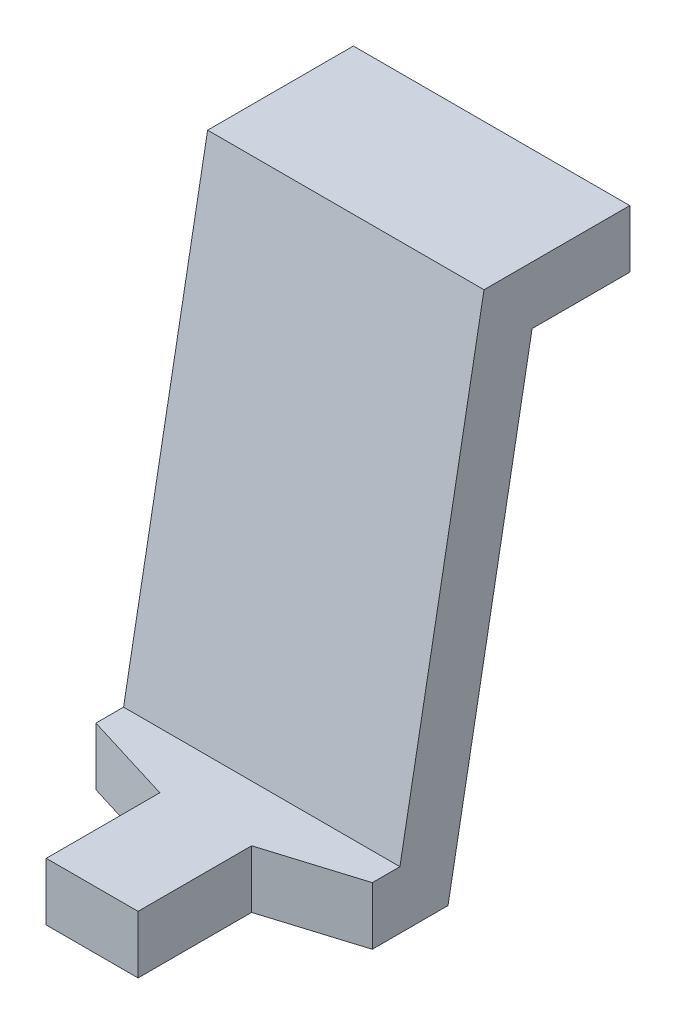
ISO-10303-21;
HEADER;
FILE_DESCRIPTION(('STEP AP214'),'2;1');
FILE_NAME('part.step','',(''),(''),'','','');
FILE_SCHEMA(('AUTOMOTIVE_DESIGN { 1 0 10303 214 1 1 1 1 }'));
ENDSEC;
DATA;
#1=APPLICATION_CONTEXT('core data for automotive mechanical design processes');
#2=APPLICATION_PROTOCOL_DEFINITION('international standard','automotive_design',2000,#1);
#3=PRODUCT_CONTEXT('',#1,'mechanical');
#4=PRODUCT('Part','Part','',(#3));
#5=PRODUCT_RELATED_PRODUCT_CATEGORY('part','',(#4));
#6=PRODUCT_DEFINITION_FORMATION('','',#4);
#7=PRODUCT_DEFINITION_CONTEXT('part definition',#1,'design');
#8=PRODUCT_DEFINITION('design','',#6,#7);
#9=PRODUCT_DEFINITION_SHAPE('','',#8);
#10=(LENGTH_UNIT() NAMED_UNIT(*) SI_UNIT(.MILLI.,.METRE.));
#11=(NAMED_UNIT(*) PLANE_ANGLE_UNIT() SI_UNIT($,.RADIAN.));
#12=(NAMED_UNIT(*) SI_UNIT($,.STERADIAN.) SOLID_ANGLE_UNIT());
#13=UNCERTAINTY_MEASURE_WITH_UNIT(LENGTH_MEASURE(1.E-05),#10,'distance_accuracy_value','');
#14=(GEOMETRIC_REPRESENTATION_CONTEXT(3) GLOBAL_UNCERTAINTY_ASSIGNED_CONTEXT((#13)) GLOBAL_UNIT_ASSIGNED_CONTEXT((#10,
#11,#12)) REPRESENTATION_CONTEXT('',''));
#15=CARTESIAN_POINT('',(0.,0.,0.));
#16=DIRECTION('',(0.,0.,1.));
#17=DIRECTION('',(1.,0.,0.));
#18=AXIS2_PLACEMENT_3D('',#15,#16,#17);
#19=CARTESIAN_POINT('',(0.4875,-2.7225,1.91));
#20=DIRECTION('',(1.,0.,0.));
#21=DIRECTION('',(0.,0.,-1.));
#22=AXIS2_PLACEMENT_3D('',#19,#20,#21);
#23=PLANE('',#22);
#24=DIRECTION('',(0.,0.,-1.));
#25=VECTOR('',#24,1.);
#26=CARTESIAN_POINT('',(0.4875,-2.4175,1.91));
#27=LINE('',#26,#25);
#28=CARTESIAN_POINT('',(0.4875,-2.4175,1.91));
#29=VERTEX_POINT('',#28);
#30=CARTESIAN_POINT('',(0.4875,-2.4175,1.31));
#31=VERTEX_POINT('',#30);
#32=EDGE_CURVE('E189',#29,#31,#27,.T.);
#33=ORIENTED_EDGE('',*,*,#32,.T.);
#34=DIRECTION('',(0.,1.,0.));
#35=VECTOR('',#34,1.);
#36=CARTESIAN_POINT('',(0.4875,-2.7225,1.31));
#37=LINE('',#36,#35);
#38=CARTESIAN_POINT('',(0.4875,-2.7225,1.31));
#39=VERTEX_POINT('',#38);
#40=EDGE_CURVE('E11',#39,#31,#37,.T.);
#41=ORIENTED_EDGE('',*,*,#40,.F.);
#42=DIRECTION('',(0.,0.,-1.));
#43=VECTOR('',#42,1.);
#44=CARTESIAN_POINT('',(0.4875,-2.7225,1.91));
#45=LINE('',#44,#43);
#46=CARTESIAN_POINT('',(0.4875,-2.7225,1.91));
#47=VERTEX_POINT('',#46);
#48=EDGE_CURVE('E207',#47,#39,#45,.T.);
#49=ORIENTED_EDGE('',*,*,#48,.F.);
#50=DIRECTION('',(0.,1.,0.));
#51=VECTOR('',#50,1.);
#52=CARTESIAN_POINT('',(0.4875,-2.7225,1.91));
#53=LINE('',#52,#51);
#54=EDGE_CURVE('E197',#47,#29,#53,.T.);
#55=ORIENTED_EDGE('',*,*,#54,.T.);
#56=EDGE_LOOP('',(#33,#41,#49,#55));
#57=FACE_BOUND('',#56,.T.);
#58=ADVANCED_FACE('F17',(#57),#23,.F.);
#59=CARTESIAN_POINT('',(0.4875,-2.7225,1.31));
#60=DIRECTION('',(0.294085848837945,0.,-0.95577900872182));
#61=DIRECTION('',(0.,-1.,0.));
#62=AXIS2_PLACEMENT_3D('',#59,#60,#61);
#63=PLANE('',#62);
#64=DIRECTION('',(-0.95577900872182,0.,-0.294085848837945));
#65=VECTOR('',#64,1.);
#66=CARTESIAN_POINT('',(0.4875,-2.4175,1.31));
#67=LINE('',#66,#65);
#68=CARTESIAN_POINT('',(0.,-2.4175,1.16));
#69=VERTEX_POINT('',#68);
#70=EDGE_CURVE('E181',#31,#69,#67,.T.);
#71=ORIENTED_EDGE('',*,*,#70,.T.);
#72=DIRECTION('',(0.,1.,0.));
#73=VECTOR('',#72,1.);
#74=CARTESIAN_POINT('',(0.,-2.7225,1.16));
#75=LINE('',#74,#73);
#76=CARTESIAN_POINT('',(0.,-2.7225,1.16));
#77=VERTEX_POINT('',#76);
#78=EDGE_CURVE('E145',#77,#69,#75,.T.);
#79=ORIENTED_EDGE('',*,*,#78,.F.);
#80=DIRECTION('',(-0.95577900872182,0.,-0.294085848837945));
#81=VECTOR('',#80,1.);
#82=CARTESIAN_POINT('',(0.4875,-2.7225,1.31));
#83=LINE('',#82,#81);
#84=EDGE_CURVE('E211',#39,#77,#83,.T.);
#85=ORIENTED_EDGE('',*,*,#84,.F.);
#86=ORIENTED_EDGE('',*,*,#40,.T.);
#87=EDGE_LOOP('',(#71,#79,#85,#86));
#88=FACE_BOUND('',#87,.T.);
#89=ADVANCED_FACE('F19',(#88),#63,.F.);
#90=CARTESIAN_POINT('',(0.9725,-2.7225,1.31));
#91=DIRECTION('',(-0.294085848837945,0.,-0.95577900872182));
#92=DIRECTION('',(-0.95577900872182,0.,0.294085848837945));
#93=AXIS2_PLACEMENT_3D('',#90,#91,#92);
#94=PLANE('',#93);
#95=DIRECTION('',(-0.95577900872182,0.,0.294085848837945));
#96=VECTOR('',#95,1.);
#97=CARTESIAN_POINT('',(0.9725,-2.4175,1.31));
#98=LINE('',#97,#96);
#99=CARTESIAN_POINT('',(1.46,-2.4175,1.16));
#100=VERTEX_POINT('',#99);
#101=CARTESIAN_POINT('',(0.9725,-2.4175,1.31));
#102=VERTEX_POINT('',#101);
#103=EDGE_CURVE('E171',#100,#102,#98,.T.);
#104=ORIENTED_EDGE('',*,*,#103,.T.);
#105=DIRECTION('',(0.,1.,0.));
#106=VECTOR('',#105,1.);
#107=CARTESIAN_POINT('',(0.9725,-2.7225,1.31));
#108=LINE('',#107,#106);
#109=CARTESIAN_POINT('',(0.9725,-2.7225,1.31));
#110=VERTEX_POINT('',#109);
#111=EDGE_CURVE('E21',#110,#102,#108,.T.);
#112=ORIENTED_EDGE('',*,*,#111,.F.);
#113=DIRECTION('',(-0.95577900872182,0.,0.294085848837945));
#114=VECTOR('',#113,1.);
#115=CARTESIAN_POINT('',(0.9725,-2.7225,1.31));
#116=LINE('',#115,#114);
#117=CARTESIAN_POINT('',(1.46,-2.7225,1.16));
#118=VERTEX_POINT('',#117);
#119=EDGE_CURVE('E227',#118,#110,#116,.T.);
#120=ORIENTED_EDGE('',*,*,#119,.F.);
#121=DIRECTION('',(0.,1.,0.));
#122=VECTOR('',#121,1.);
#123=CARTESIAN_POINT('',(1.46,-2.7225,1.16));
#124=LINE('',#123,#122);
#125=EDGE_CURVE('E146',#118,#100,#124,.T.);
#126=ORIENTED_EDGE('',*,*,#125,.T.);
#127=EDGE_LOOP('',(#104,#112,#120,#126));
#128=FACE_BOUND('',#127,.T.);
#129=ADVANCED_FACE('F266',(#128),#94,.F.);
#130=CARTESIAN_POINT('',(0.9725,-2.7225,1.91));
#131=DIRECTION('',(-1.,0.,0.));
#132=DIRECTION('',(0.,0.,1.));
#133=AXIS2_PLACEMENT_3D('',#130,#131,#132);
#134=PLANE('',#133);
#135=DIRECTION('',(0.,0.,1.));
#136=VECTOR('',#135,1.);
#137=CARTESIAN_POINT('',(0.9725,-2.4175,1.91));
#138=LINE('',#137,#136);
#139=CARTESIAN_POINT('',(0.9725,-2.4175,1.91));
#140=VERTEX_POINT('',#139);
#141=EDGE_CURVE('E168',#102,#140,#138,.T.);
#142=ORIENTED_EDGE('',*,*,#141,.T.);
#143=DIRECTION('',(0.,1.,0.));
#144=VECTOR('',#143,1.);
#145=CARTESIAN_POINT('',(0.9725,-2.7225,1.91));
#146=LINE('',#145,#144);
#147=CARTESIAN_POINT('',(0.9725,-2.7225,1.91));
#148=VERTEX_POINT('',#147);
#149=EDGE_CURVE('E204',#148,#140,#146,.T.);
#150=ORIENTED_EDGE('',*,*,#149,.F.);
#151=DIRECTION('',(0.,0.,1.));
#152=VECTOR('',#151,1.);
#153=CARTESIAN_POINT('',(0.9725,-2.7225,1.91));
#154=LINE('',#153,#152);
#155=EDGE_CURVE('E231',#110,#148,#154,.T.);
#156=ORIENTED_EDGE('',*,*,#155,.F.);
#157=ORIENTED_EDGE('',*,*,#111,.T.);
#158=EDGE_LOOP('',(#142,#150,#156,#157));
#159=FACE_BOUND('',#158,.T.);
#160=ADVANCED_FACE('F259',(#159),#134,.F.);
#161=CARTESIAN_POINT('',(0.,-0.305,-0.2));
#162=DIRECTION('',(0.,0.,1.));
#163=DIRECTION('',(1.,0.,0.));
#164=AXIS2_PLACEMENT_3D('',#161,#162,#163);
#165=PLANE('',#164);
#166=DIRECTION('',(0.,1.,0.));
#167=VECTOR('',#166,1.);
#168=CARTESIAN_POINT('',(0.,0.,-0.2));
#169=LINE('',#168,#167);
#170=CARTESIAN_POINT('',(0.,-0.305,-0.2));
#171=VERTEX_POINT('',#170);
#172=CARTESIAN_POINT('',(0.,0.,-0.2));
#173=VERTEX_POINT('',#172);
#174=EDGE_CURVE('E49',#171,#173,#169,.T.);
#175=ORIENTED_EDGE('',*,*,#174,.T.);
#176=DIRECTION('',(1.,0.,0.));
#177=VECTOR('',#176,1.);
#178=CARTESIAN_POINT('',(0.,0.,-0.2));
#179=LINE('',#178,#177);
#180=CARTESIAN_POINT('',(1.46,0.,-0.2));
#181=VERTEX_POINT('',#180);
#182=EDGE_CURVE('E149',#173,#181,#179,.T.);
#183=ORIENTED_EDGE('',*,*,#182,.T.);
#184=DIRECTION('',(0.,-1.,0.));
#185=VECTOR('',#184,1.);
#186=CARTESIAN_POINT('',(1.46,0.,-0.2));
#187=LINE('',#186,#185);
#188=CARTESIAN_POINT('',(1.46,-0.305,-0.2));
#189=VERTEX_POINT('',#188);
#190=EDGE_CURVE('E39',#181,#189,#187,.T.);
#191=ORIENTED_EDGE('',*,*,#190,.T.);
#192=DIRECTION('',(-1.,0.,0.));
#193=VECTOR('',#192,1.);
#194=CARTESIAN_POINT('',(0.,-0.305,-0.2));
#195=LINE('',#194,#193);
#196=EDGE_CURVE('E185',#189,#171,#195,.T.);
#197=ORIENTED_EDGE('',*,*,#196,.T.);
#198=EDGE_LOOP('',(#175,#183,#191,#197));
#199=FACE_BOUND('',#198,.T.);
#200=ADVANCED_FACE('F150',(#199),#165,.F.);
#201=CARTESIAN_POINT('',(0.,0.,0.));
#202=DIRECTION('',(1.,0.,0.));
#203=DIRECTION('',(0.,1.,0.));
#204=AXIS2_PLACEMENT_3D('',#201,#202,#203);
#205=PLANE('',#204);
#206=DIRECTION('',(0.,0.,-1.));
#207=VECTOR('',#206,1.);
#208=CARTESIAN_POINT('',(0.,-2.7225,1.91));
#209=LINE('',#208,#207);
#210=CARTESIAN_POINT('',(0.,-2.7225,0.76));
#211=VERTEX_POINT('',#210);
#212=EDGE_CURVE('E214',#77,#211,#209,.T.);
#213=ORIENTED_EDGE('',*,*,#212,.F.);
#214=ORIENTED_EDGE('',*,*,#78,.T.);
#215=DIRECTION('',(0.,0.,1.));
#216=VECTOR('',#215,1.);
#217=CARTESIAN_POINT('',(0.,-2.4175,1.014076867959));
#218=LINE('',#217,#216);
#219=CARTESIAN_POINT('',(0.,-2.4175,1.014076867959));
#220=VERTEX_POINT('',#219);
#221=EDGE_CURVE('E177',#220,#69,#218,.T.);
#222=ORIENTED_EDGE('',*,*,#221,.F.);
#223=DIRECTION('',(0.,-0.983543822347074,0.180669724976013));
#224=VECTOR('',#223,1.);
#225=CARTESIAN_POINT('',(0.,0.,0.57));
#226=LINE('',#225,#224);
#227=CARTESIAN_POINT('',(0.,0.,0.57));
#228=VERTEX_POINT('',#227);
#229=EDGE_CURVE('E154',#228,#220,#226,.T.);
#230=ORIENTED_EDGE('',*,*,#229,.F.);
#231=DIRECTION('',(0.,0.,1.));
#232=VECTOR('',#231,1.);
#233=CARTESIAN_POINT('',(0.,0.,0.));
#234=LINE('',#233,#232);
#235=EDGE_CURVE('E164',#173,#228,#234,.T.);
#236=ORIENTED_EDGE('',*,*,#235,.F.);
#237=ORIENTED_EDGE('',*,*,#174,.F.);
#238=DIRECTION('',(0.,0.,-1.));
#239=VECTOR('',#238,1.);
#240=CARTESIAN_POINT('',(0.,-0.305,0.315923132041));
#241=LINE('',#240,#239);
#242=CARTESIAN_POINT('',(0.,-0.305,0.315923132041));
#243=VERTEX_POINT('',#242);
#244=EDGE_CURVE('E241',#243,#171,#241,.T.);
#245=ORIENTED_EDGE('',*,*,#244,.F.);
#246=DIRECTION('',(0.,0.983543822347074,-0.180669724976013));
#247=VECTOR('',#246,1.);
#248=CARTESIAN_POINT('',(0.,-2.7225,0.76));
#249=LINE('',#248,#247);
#250=EDGE_CURVE('E234',#211,#243,#249,.T.);
#251=ORIENTED_EDGE('',*,*,#250,.F.);
#252=EDGE_LOOP('',(#213,#214,#222,#230,#236,#237,#245,#251));
#253=FACE_BOUND('',#252,.T.);
#254=ADVANCED_FACE('F288',(#253),#205,.F.);
#255=CARTESIAN_POINT('',(1.46,0.,0.));
#256=DIRECTION('',(1.,0.,0.));
#257=DIRECTION('',(0.,1.,0.));
#258=AXIS2_PLACEMENT_3D('',#255,#256,#257);
#259=PLANE('',#258);
#260=ORIENTED_EDGE('',*,*,#125,.F.);
#261=DIRECTION('',(0.,0.,-1.));
#262=VECTOR('',#261,1.);
#263=CARTESIAN_POINT('',(1.46,-2.7225,1.91));
#264=LINE('',#263,#262);
#265=CARTESIAN_POINT('',(1.46,-2.7225,0.76));
#266=VERTEX_POINT('',#265);
#267=EDGE_CURVE('E223',#118,#266,#264,.T.);
#268=ORIENTED_EDGE('',*,*,#267,.T.);
#269=DIRECTION('',(0.,0.983543822347074,-0.180669724976013));
#270=VECTOR('',#269,1.);
#271=CARTESIAN_POINT('',(1.46,-2.7225,0.76));
#272=LINE('',#271,#270);
#273=CARTESIAN_POINT('',(1.46,-0.305,0.315923132041));
#274=VERTEX_POINT('',#273);
#275=EDGE_CURVE('E242',#266,#274,#272,.T.);
#276=ORIENTED_EDGE('',*,*,#275,.T.);
#277=DIRECTION('',(0.,0.,-1.));
#278=VECTOR('',#277,1.);
#279=CARTESIAN_POINT('',(1.46,-0.305,0.315923132041));
#280=LINE('',#279,#278);
#281=EDGE_CURVE('E142',#274,#189,#280,.T.);
#282=ORIENTED_EDGE('',*,*,#281,.T.);
#283=ORIENTED_EDGE('',*,*,#190,.F.);
#284=DIRECTION('',(0.,0.,1.));
#285=VECTOR('',#284,1.);
#286=CARTESIAN_POINT('',(1.46,0.,0.));
#287=LINE('',#286,#285);
#288=CARTESIAN_POINT('',(1.46,0.,0.57));
#289=VERTEX_POINT('',#288);
#290=EDGE_CURVE('E139',#181,#289,#287,.T.);
#291=ORIENTED_EDGE('',*,*,#290,.T.);
#292=DIRECTION('',(0.,-0.983543822347074,0.180669724976013));
#293=VECTOR('',#292,1.);
#294=CARTESIAN_POINT('',(1.46,0.,0.57));
#295=LINE('',#294,#293);
#296=CARTESIAN_POINT('',(1.46,-2.4175,1.014076867959));
#297=VERTEX_POINT('',#296);
#298=EDGE_CURVE('E182',#289,#297,#295,.T.);
#299=ORIENTED_EDGE('',*,*,#298,.T.);
#300=DIRECTION('',(0.,0.,1.));
#301=VECTOR('',#300,1.);
#302=CARTESIAN_POINT('',(1.46,-2.4175,1.014076867959));
#303=LINE('',#302,#301);
#304=EDGE_CURVE('E193',#297,#100,#303,.T.);
#305=ORIENTED_EDGE('',*,*,#304,.T.);
#306=EDGE_LOOP('',(#260,#268,#276,#282,#283,#291,#299,#305));
#307=FACE_BOUND('',#306,.T.);
#308=ADVANCED_FACE('F136',(#307),#259,.T.);
#309=CARTESIAN_POINT('',(1.46,-0.305,0.315923132041));
#310=DIRECTION('',(0.,1.,0.));
#311=DIRECTION('',(1.,0.,0.));
#312=AXIS2_PLACEMENT_3D('',#309,#310,#311);
#313=PLANE('',#312);
#314=ORIENTED_EDGE('',*,*,#244,.T.);
#315=ORIENTED_EDGE('',*,*,#196,.F.);
#316=ORIENTED_EDGE('',*,*,#281,.F.);
#317=DIRECTION('',(-1.,0.,0.));
#318=VECTOR('',#317,1.);
#319=CARTESIAN_POINT('',(1.46,-0.305,0.315923132041));
#320=LINE('',#319,#318);
#321=EDGE_CURVE('E238',#274,#243,#320,.T.);
#322=ORIENTED_EDGE('',*,*,#321,.T.);
#323=EDGE_LOOP('',(#314,#315,#316,#322));
#324=FACE_BOUND('',#323,.T.);
#325=ADVANCED_FACE('F304',(#324),#313,.F.);
#326=CARTESIAN_POINT('',(1.46,-2.7225,0.76));
#327=DIRECTION('',(0.,0.180669724976013,0.983543822347074));
#328=DIRECTION('',(1.,0.,0.));
#329=AXIS2_PLACEMENT_3D('',#326,#327,#328);
#330=PLANE('',#329);
#331=ORIENTED_EDGE('',*,*,#250,.T.);
#332=ORIENTED_EDGE('',*,*,#321,.F.);
#333=ORIENTED_EDGE('',*,*,#275,.F.);
#334=DIRECTION('',(-1.,0.,0.));
#335=VECTOR('',#334,1.);
#336=CARTESIAN_POINT('',(1.46,-2.7225,0.76));
#337=LINE('',#336,#335);
#338=EDGE_CURVE('E219',#266,#211,#337,.T.);
#339=ORIENTED_EDGE('',*,*,#338,.T.);
#340=EDGE_LOOP('',(#331,#332,#333,#339));
#341=FACE_BOUND('',#340,.T.);
#342=ADVANCED_FACE('F306',(#341),#330,.F.);
#343=CARTESIAN_POINT('',(1.46,-2.7225,1.91));
#344=DIRECTION('',(0.,1.,0.));
#345=DIRECTION('',(1.,0.,0.));
#346=AXIS2_PLACEMENT_3D('',#343,#344,#345);
#347=PLANE('',#346);
#348=ORIENTED_EDGE('',*,*,#48,.T.);
#349=ORIENTED_EDGE('',*,*,#84,.T.);
#350=ORIENTED_EDGE('',*,*,#212,.T.);
#351=ORIENTED_EDGE('',*,*,#338,.F.);
#352=ORIENTED_EDGE('',*,*,#267,.F.);
#353=ORIENTED_EDGE('',*,*,#119,.T.);
#354=ORIENTED_EDGE('',*,*,#155,.T.);
#355=DIRECTION('',(-1.,0.,0.));
#356=VECTOR('',#355,1.);
#357=CARTESIAN_POINT('',(1.46,-2.7225,1.91));
#358=LINE('',#357,#356);
#359=EDGE_CURVE('E200',#148,#47,#358,.T.);
#360=ORIENTED_EDGE('',*,*,#359,.T.);
#361=EDGE_LOOP('',(#348,#349,#350,#351,#352,#353,#354,#360));
#362=FACE_BOUND('',#361,.T.);
#363=ADVANCED_FACE('F278',(#362),#347,.F.);
#364=CARTESIAN_POINT('',(1.46,-2.4175,1.91));
#365=DIRECTION('',(0.,0.,-1.));
#366=DIRECTION('',(-1.,0.,0.));
#367=AXIS2_PLACEMENT_3D('',#364,#365,#366);
#368=PLANE('',#367);
#369=DIRECTION('',(-1.,0.,0.));
#370=VECTOR('',#369,1.);
#371=CARTESIAN_POINT('',(1.46,-2.4175,1.91));
#372=LINE('',#371,#370);
#373=EDGE_CURVE('E172',#140,#29,#372,.T.);
#374=ORIENTED_EDGE('',*,*,#373,.T.);
#375=ORIENTED_EDGE('',*,*,#54,.F.);
#376=ORIENTED_EDGE('',*,*,#359,.F.);
#377=ORIENTED_EDGE('',*,*,#149,.T.);
#378=EDGE_LOOP('',(#374,#375,#376,#377));
#379=FACE_BOUND('',#378,.T.);
#380=ADVANCED_FACE('F275',(#379),#368,.F.);
#381=CARTESIAN_POINT('',(1.46,-2.4175,1.014076867959));
#382=DIRECTION('',(0.,-1.,0.));
#383=DIRECTION('',(0.,0.,-1.));
#384=AXIS2_PLACEMENT_3D('',#381,#382,#383);
#385=PLANE('',#384);
#386=ORIENTED_EDGE('',*,*,#221,.T.);
#387=ORIENTED_EDGE('',*,*,#70,.F.);
#388=ORIENTED_EDGE('',*,*,#32,.F.);
#389=ORIENTED_EDGE('',*,*,#373,.F.);
#390=ORIENTED_EDGE('',*,*,#141,.F.);
#391=ORIENTED_EDGE('',*,*,#103,.F.);
#392=ORIENTED_EDGE('',*,*,#304,.F.);
#393=DIRECTION('',(-1.,0.,0.));
#394=VECTOR('',#393,1.);
#395=CARTESIAN_POINT('',(1.46,-2.4175,1.014076867959));
#396=LINE('',#395,#394);
#397=EDGE_CURVE('E176',#297,#220,#396,.T.);
#398=ORIENTED_EDGE('',*,*,#397,.T.);
#399=EDGE_LOOP('',(#386,#387,#388,#389,#390,#391,#392,#398));
#400=FACE_BOUND('',#399,.T.);
#401=ADVANCED_FACE('F270',(#400),#385,.F.);
#402=CARTESIAN_POINT('',(1.46,0.,0.57));
#403=DIRECTION('',(0.,-0.180669724976013,-0.983543822347074));
#404=DIRECTION('',(0.,-0.983543822347074,0.180669724976013));
#405=AXIS2_PLACEMENT_3D('',#402,#403,#404);
#406=PLANE('',#405);
#407=ORIENTED_EDGE('',*,*,#229,.T.);
#408=ORIENTED_EDGE('',*,*,#397,.F.);
#409=ORIENTED_EDGE('',*,*,#298,.F.);
#410=DIRECTION('',(-1.,0.,0.));
#411=VECTOR('',#410,1.);
#412=CARTESIAN_POINT('',(1.46,0.,0.57));
#413=LINE('',#412,#411);
#414=EDGE_CURVE('E158',#289,#228,#413,.T.);
#415=ORIENTED_EDGE('',*,*,#414,.T.);
#416=EDGE_LOOP('',(#407,#408,#409,#415));
#417=FACE_BOUND('',#416,.T.);
#418=ADVANCED_FACE('F286',(#417),#406,.F.);
#419=CARTESIAN_POINT('',(1.46,0.,0.));
#420=DIRECTION('',(0.,-1.,0.));
#421=DIRECTION('',(0.,0.,-1.));
#422=AXIS2_PLACEMENT_3D('',#419,#420,#421);
#423=PLANE('',#422);
#424=ORIENTED_EDGE('',*,*,#235,.T.);
#425=ORIENTED_EDGE('',*,*,#414,.F.);
#426=ORIENTED_EDGE('',*,*,#290,.F.);
#427=ORIENTED_EDGE('',*,*,#182,.F.);
#428=EDGE_LOOP('',(#424,#425,#426,#427));
#429=FACE_BOUND('',#428,.T.);
#430=ADVANCED_FACE('F156',(#429),#423,.F.);
#431=CLOSED_SHELL('',(#58,#89,#129,#160,#200,#254,#308,#325,#342,#363,#380,#401,#418,#430));
#432=MANIFOLD_SOLID_BREP('B1',#431);
#433=ADVANCED_BREP_SHAPE_REPRESENTATION('',(#18,#432),#14);
#434=SHAPE_DEFINITION_REPRESENTATION(#9,#433);
ENDSEC;
END-ISO-10303-21;
